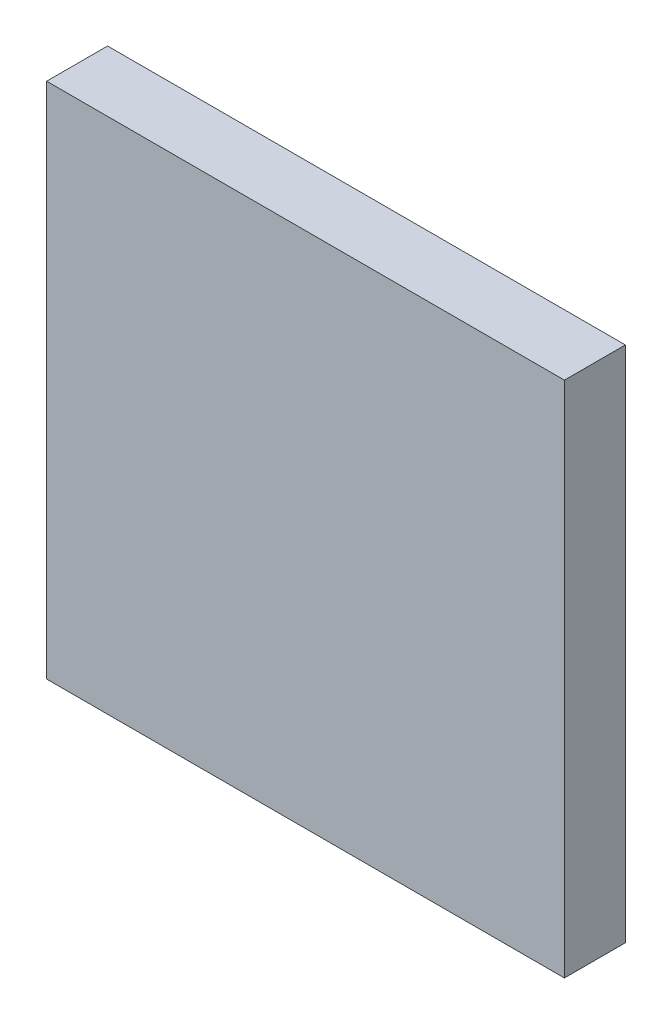
ISO-10303-21;
HEADER;
FILE_DESCRIPTION(('STEP AP214'),'2;1');
FILE_NAME('part.step','',(''),(''),'','','');
FILE_SCHEMA(('AUTOMOTIVE_DESIGN { 1 0 10303 214 1 1 1 1 }'));
ENDSEC;
DATA;
#1=APPLICATION_CONTEXT('core data for automotive mechanical design processes');
#2=APPLICATION_PROTOCOL_DEFINITION('international standard','automotive_design',2000,#1);
#3=PRODUCT_CONTEXT('',#1,'mechanical');
#4=PRODUCT('Part','Part','',(#3));
#5=PRODUCT_RELATED_PRODUCT_CATEGORY('part','',(#4));
#6=PRODUCT_DEFINITION_FORMATION('','',#4);
#7=PRODUCT_DEFINITION_CONTEXT('part definition',#1,'design');
#8=PRODUCT_DEFINITION('design','',#6,#7);
#9=PRODUCT_DEFINITION_SHAPE('','',#8);
#10=(LENGTH_UNIT() NAMED_UNIT(*) SI_UNIT(.MILLI.,.METRE.));
#11=(NAMED_UNIT(*) PLANE_ANGLE_UNIT() SI_UNIT($,.RADIAN.));
#12=(NAMED_UNIT(*) SI_UNIT($,.STERADIAN.) SOLID_ANGLE_UNIT());
#13=UNCERTAINTY_MEASURE_WITH_UNIT(LENGTH_MEASURE(1.E-05),#10,'distance_accuracy_value','');
#14=(GEOMETRIC_REPRESENTATION_CONTEXT(3) GLOBAL_UNCERTAINTY_ASSIGNED_CONTEXT((#13)) GLOBAL_UNIT_ASSIGNED_CONTEXT((#10,
#11,#12)) REPRESENTATION_CONTEXT('',''));
#15=CARTESIAN_POINT('',(0.,0.,0.));
#16=DIRECTION('',(0.,0.,1.));
#17=DIRECTION('',(1.,0.,0.));
#18=AXIS2_PLACEMENT_3D('',#15,#16,#17);
#19=CARTESIAN_POINT('',(0.,0.,0.729999999999874));
#20=DIRECTION('',(0.,0.,1.));
#21=DIRECTION('',(1.,0.,0.));
#22=AXIS2_PLACEMENT_3D('',#19,#20,#21);
#23=PLANE('',#22);
#24=DIRECTION('',(1.,0.,0.));
#25=VECTOR('',#24,1.);
#26=CARTESIAN_POINT('',(-3.1000000000003,-3.1000000000003,0.729999999999874));
#27=LINE('',#26,#25);
#28=CARTESIAN_POINT('',(-3.1000000000003,-3.1000000000003,0.729999999999874));
#29=VERTEX_POINT('',#28);
#30=CARTESIAN_POINT('',(3.1000000000003,-3.1000000000003,0.729999999999874));
#31=VERTEX_POINT('',#30);
#32=EDGE_CURVE('E104',#29,#31,#27,.T.);
#33=ORIENTED_EDGE('',*,*,#32,.T.);
#34=DIRECTION('',(0.,1.,0.));
#35=VECTOR('',#34,1.);
#36=CARTESIAN_POINT('',(3.1000000000003,-3.1000000000003,0.729999999999874));
#37=LINE('',#36,#35);
#38=CARTESIAN_POINT('',(3.1000000000003,3.1000000000003,0.729999999999874));
#39=VERTEX_POINT('',#38);
#40=EDGE_CURVE('E11',#31,#39,#37,.T.);
#41=ORIENTED_EDGE('',*,*,#40,.T.);
#42=DIRECTION('',(-1.,0.,0.));
#43=VECTOR('',#42,1.);
#44=CARTESIAN_POINT('',(3.1000000000003,3.1000000000003,0.729999999999874));
#45=LINE('',#44,#43);
#46=CARTESIAN_POINT('',(-3.1000000000003,3.1000000000003,0.729999999999874));
#47=VERTEX_POINT('',#46);
#48=EDGE_CURVE('E75',#39,#47,#45,.T.);
#49=ORIENTED_EDGE('',*,*,#48,.T.);
#50=DIRECTION('',(0.,-1.,0.));
#51=VECTOR('',#50,1.);
#52=CARTESIAN_POINT('',(-3.1000000000003,3.1000000000003,0.729999999999874));
#53=LINE('',#52,#51);
#54=EDGE_CURVE('E100',#47,#29,#53,.T.);
#55=ORIENTED_EDGE('',*,*,#54,.T.);
#56=EDGE_LOOP('',(#33,#41,#49,#55));
#57=FACE_BOUND('',#56,.T.);
#58=ADVANCED_FACE('F17',(#57),#23,.T.);
#59=CARTESIAN_POINT('',(3.1000000000003,-3.1000000000003,0.));
#60=DIRECTION('',(1.,0.,0.));
#61=DIRECTION('',(0.,1.,0.));
#62=AXIS2_PLACEMENT_3D('',#59,#60,#61);
#63=PLANE('',#62);
#64=DIRECTION('',(0.,1.,0.));
#65=VECTOR('',#64,1.);
#66=CARTESIAN_POINT('',(3.1000000000003,-3.1000000000003,0.));
#67=LINE('',#66,#65);
#68=CARTESIAN_POINT('',(3.1000000000003,-3.1000000000003,0.));
#69=VERTEX_POINT('',#68);
#70=CARTESIAN_POINT('',(3.1000000000003,3.1000000000003,0.));
#71=VERTEX_POINT('',#70);
#72=EDGE_CURVE('E78',#69,#71,#67,.T.);
#73=ORIENTED_EDGE('',*,*,#72,.T.);
#74=DIRECTION('',(0.,0.,1.));
#75=VECTOR('',#74,1.);
#76=CARTESIAN_POINT('',(3.1000000000003,3.1000000000003,0.));
#77=LINE('',#76,#75);
#78=EDGE_CURVE('E28',#71,#39,#77,.T.);
#79=ORIENTED_EDGE('',*,*,#78,.T.);
#80=ORIENTED_EDGE('',*,*,#40,.F.);
#81=DIRECTION('',(0.,0.,1.));
#82=VECTOR('',#81,1.);
#83=CARTESIAN_POINT('',(3.1000000000003,-3.1000000000003,0.));
#84=LINE('',#83,#82);
#85=EDGE_CURVE('E81',#69,#31,#84,.T.);
#86=ORIENTED_EDGE('',*,*,#85,.F.);
#87=EDGE_LOOP('',(#73,#79,#80,#86));
#88=FACE_BOUND('',#87,.T.);
#89=ADVANCED_FACE('F79',(#88),#63,.T.);
#90=CARTESIAN_POINT('',(3.1000000000003,3.1000000000003,0.));
#91=DIRECTION('',(0.,1.,0.));
#92=DIRECTION('',(1.,0.,0.));
#93=AXIS2_PLACEMENT_3D('',#90,#91,#92);
#94=PLANE('',#93);
#95=DIRECTION('',(-1.,0.,0.));
#96=VECTOR('',#95,1.);
#97=CARTESIAN_POINT('',(3.1000000000003,3.1000000000003,0.));
#98=LINE('',#97,#96);
#99=CARTESIAN_POINT('',(-3.1000000000003,3.1000000000003,0.));
#100=VERTEX_POINT('',#99);
#101=EDGE_CURVE('E73',#71,#100,#98,.T.);
#102=ORIENTED_EDGE('',*,*,#101,.T.);
#103=DIRECTION('',(0.,0.,1.));
#104=VECTOR('',#103,1.);
#105=CARTESIAN_POINT('',(-3.1000000000003,3.1000000000003,0.));
#106=LINE('',#105,#104);
#107=EDGE_CURVE('E105',#100,#47,#106,.T.);
#108=ORIENTED_EDGE('',*,*,#107,.T.);
#109=ORIENTED_EDGE('',*,*,#48,.F.);
#110=ORIENTED_EDGE('',*,*,#78,.F.);
#111=EDGE_LOOP('',(#102,#108,#109,#110));
#112=FACE_BOUND('',#111,.T.);
#113=ADVANCED_FACE('F70',(#112),#94,.T.);
#114=CARTESIAN_POINT('',(-3.1000000000003,3.1000000000003,0.));
#115=DIRECTION('',(-1.,0.,0.));
#116=DIRECTION('',(0.,0.,1.));
#117=AXIS2_PLACEMENT_3D('',#114,#115,#116);
#118=PLANE('',#117);
#119=DIRECTION('',(0.,-1.,0.));
#120=VECTOR('',#119,1.);
#121=CARTESIAN_POINT('',(-3.1000000000003,3.1000000000003,0.));
#122=LINE('',#121,#120);
#123=CARTESIAN_POINT('',(-3.1000000000003,-3.1000000000003,0.));
#124=VERTEX_POINT('',#123);
#125=EDGE_CURVE('E89',#100,#124,#122,.T.);
#126=ORIENTED_EDGE('',*,*,#125,.T.);
#127=DIRECTION('',(0.,0.,1.));
#128=VECTOR('',#127,1.);
#129=CARTESIAN_POINT('',(-3.1000000000003,-3.1000000000003,0.));
#130=LINE('',#129,#128);
#131=EDGE_CURVE('E21',#124,#29,#130,.T.);
#132=ORIENTED_EDGE('',*,*,#131,.T.);
#133=ORIENTED_EDGE('',*,*,#54,.F.);
#134=ORIENTED_EDGE('',*,*,#107,.F.);
#135=EDGE_LOOP('',(#126,#132,#133,#134));
#136=FACE_BOUND('',#135,.T.);
#137=ADVANCED_FACE('F116',(#136),#118,.T.);
#138=CARTESIAN_POINT('',(-3.1000000000003,-3.1000000000003,0.));
#139=DIRECTION('',(0.,-1.,0.));
#140=DIRECTION('',(0.,0.,-1.));
#141=AXIS2_PLACEMENT_3D('',#138,#139,#140);
#142=PLANE('',#141);
#143=DIRECTION('',(1.,0.,0.));
#144=VECTOR('',#143,1.);
#145=CARTESIAN_POINT('',(-3.1000000000003,-3.1000000000003,0.));
#146=LINE('',#145,#144);
#147=EDGE_CURVE('E96',#124,#69,#146,.T.);
#148=ORIENTED_EDGE('',*,*,#147,.T.);
#149=ORIENTED_EDGE('',*,*,#85,.T.);
#150=ORIENTED_EDGE('',*,*,#32,.F.);
#151=ORIENTED_EDGE('',*,*,#131,.F.);
#152=EDGE_LOOP('',(#148,#149,#150,#151));
#153=FACE_BOUND('',#152,.T.);
#154=ADVANCED_FACE('F19',(#153),#142,.T.);
#155=CARTESIAN_POINT('',(0.,0.,0.));
#156=DIRECTION('',(0.,0.,1.));
#157=DIRECTION('',(1.,0.,0.));
#158=AXIS2_PLACEMENT_3D('',#155,#156,#157);
#159=PLANE('',#158);
#160=ORIENTED_EDGE('',*,*,#147,.F.);
#161=ORIENTED_EDGE('',*,*,#125,.F.);
#162=ORIENTED_EDGE('',*,*,#101,.F.);
#163=ORIENTED_EDGE('',*,*,#72,.F.);
#164=EDGE_LOOP('',(#160,#161,#162,#163));
#165=FACE_BOUND('',#164,.T.);
#166=ADVANCED_FACE('F87',(#165),#159,.F.);
#167=CLOSED_SHELL('',(#58,#89,#113,#137,#154,#166));
#168=MANIFOLD_SOLID_BREP('B1',#167);
#169=ADVANCED_BREP_SHAPE_REPRESENTATION('',(#18,#168),#14);
#170=SHAPE_DEFINITION_REPRESENTATION(#9,#169);
ENDSEC;
END-ISO-10303-21;
